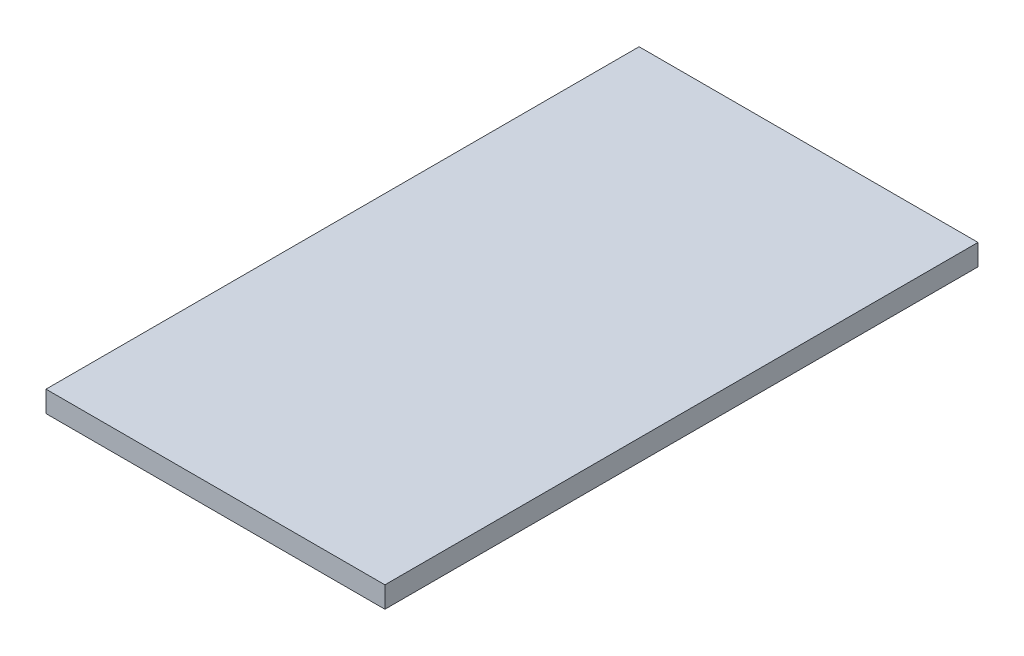
ISO-10303-21;
HEADER;
FILE_DESCRIPTION(('STEP AP214'),'2;1');
FILE_NAME('part.step','',(''),(''),'','','');
FILE_SCHEMA(('AUTOMOTIVE_DESIGN { 1 0 10303 214 1 1 1 1 }'));
ENDSEC;
DATA;
#1=APPLICATION_CONTEXT('core data for automotive mechanical design processes');
#2=APPLICATION_PROTOCOL_DEFINITION('international standard','automotive_design',2000,#1);
#3=PRODUCT_CONTEXT('',#1,'mechanical');
#4=PRODUCT('Part','Part','',(#3));
#5=PRODUCT_RELATED_PRODUCT_CATEGORY('part','',(#4));
#6=PRODUCT_DEFINITION_FORMATION('','',#4);
#7=PRODUCT_DEFINITION_CONTEXT('part definition',#1,'design');
#8=PRODUCT_DEFINITION('design','',#6,#7);
#9=PRODUCT_DEFINITION_SHAPE('','',#8);
#10=(LENGTH_UNIT() NAMED_UNIT(*) SI_UNIT(.MILLI.,.METRE.));
#11=(NAMED_UNIT(*) PLANE_ANGLE_UNIT() SI_UNIT($,.RADIAN.));
#12=(NAMED_UNIT(*) SI_UNIT($,.STERADIAN.) SOLID_ANGLE_UNIT());
#13=UNCERTAINTY_MEASURE_WITH_UNIT(LENGTH_MEASURE(1.E-05),#10,'distance_accuracy_value','');
#14=(GEOMETRIC_REPRESENTATION_CONTEXT(3) GLOBAL_UNCERTAINTY_ASSIGNED_CONTEXT((#13)) GLOBAL_UNIT_ASSIGNED_CONTEXT((#10,
#11,#12)) REPRESENTATION_CONTEXT('',''));
#15=CARTESIAN_POINT('',(0.,0.,0.));
#16=DIRECTION('',(0.,0.,1.));
#17=DIRECTION('',(1.,0.,0.));
#18=AXIS2_PLACEMENT_3D('',#15,#16,#17);
#19=CARTESIAN_POINT('',(-70.2950819672131,10.,-43.2786885245901));
#20=DIRECTION('',(1.,0.,0.));
#21=DIRECTION('',(0.,0.,-1.));
#22=AXIS2_PLACEMENT_3D('',#19,#20,#21);
#23=PLANE('',#22);
#24=DIRECTION('',(0.,0.,1.));
#25=VECTOR('',#24,1.);
#26=CARTESIAN_POINT('',(-70.2950819672131,0.,-43.2786885245901));
#27=LINE('',#26,#25);
#28=CARTESIAN_POINT('',(-70.2950819672131,0.,-43.2786885245901));
#29=VERTEX_POINT('',#28);
#30=CARTESIAN_POINT('',(-70.295081967213,0.,236.72131147541));
#31=VERTEX_POINT('',#30);
#32=EDGE_CURVE('E107',#29,#31,#27,.T.);
#33=ORIENTED_EDGE('',*,*,#32,.T.);
#34=DIRECTION('',(0.,-1.,0.));
#35=VECTOR('',#34,1.);
#36=CARTESIAN_POINT('',(-70.295081967213,10.,236.72131147541));
#37=LINE('',#36,#35);
#38=CARTESIAN_POINT('',(-70.295081967213,10.,236.72131147541));
#39=VERTEX_POINT('',#38);
#40=EDGE_CURVE('E11',#39,#31,#37,.T.);
#41=ORIENTED_EDGE('',*,*,#40,.F.);
#42=DIRECTION('',(0.,0.,1.));
#43=VECTOR('',#42,1.);
#44=CARTESIAN_POINT('',(-70.2950819672131,10.,-43.2786885245901));
#45=LINE('',#44,#43);
#46=CARTESIAN_POINT('',(-70.2950819672131,10.,-43.2786885245901));
#47=VERTEX_POINT('',#46);
#48=EDGE_CURVE('E91',#47,#39,#45,.T.);
#49=ORIENTED_EDGE('',*,*,#48,.F.);
#50=DIRECTION('',(0.,-1.,0.));
#51=VECTOR('',#50,1.);
#52=CARTESIAN_POINT('',(-70.2950819672131,10.,-43.2786885245901));
#53=LINE('',#52,#51);
#54=EDGE_CURVE('E103',#47,#29,#53,.T.);
#55=ORIENTED_EDGE('',*,*,#54,.T.);
#56=EDGE_LOOP('',(#33,#41,#49,#55));
#57=FACE_BOUND('',#56,.T.);
#58=ADVANCED_FACE('F39',(#57),#23,.F.);
#59=CARTESIAN_POINT('',(-70.295081967213,10.,236.72131147541));
#60=DIRECTION('',(0.,0.,-1.));
#61=DIRECTION('',(-1.,0.,0.));
#62=AXIS2_PLACEMENT_3D('',#59,#60,#61);
#63=PLANE('',#62);
#64=DIRECTION('',(1.,0.,0.));
#65=VECTOR('',#64,1.);
#66=CARTESIAN_POINT('',(-70.295081967213,0.,236.72131147541));
#67=LINE('',#66,#65);
#68=CARTESIAN_POINT('',(89.704918032787,0.,236.72131147541));
#69=VERTEX_POINT('',#68);
#70=EDGE_CURVE('E96',#31,#69,#67,.T.);
#71=ORIENTED_EDGE('',*,*,#70,.T.);
#72=DIRECTION('',(0.,-1.,0.));
#73=VECTOR('',#72,1.);
#74=CARTESIAN_POINT('',(89.704918032787,10.,236.72131147541));
#75=LINE('',#74,#73);
#76=CARTESIAN_POINT('',(89.704918032787,10.,236.72131147541));
#77=VERTEX_POINT('',#76);
#78=EDGE_CURVE('E48',#77,#69,#75,.T.);
#79=ORIENTED_EDGE('',*,*,#78,.F.);
#80=DIRECTION('',(1.,0.,0.));
#81=VECTOR('',#80,1.);
#82=CARTESIAN_POINT('',(-70.295081967213,10.,236.72131147541));
#83=LINE('',#82,#81);
#84=EDGE_CURVE('E86',#39,#77,#83,.T.);
#85=ORIENTED_EDGE('',*,*,#84,.F.);
#86=ORIENTED_EDGE('',*,*,#40,.T.);
#87=EDGE_LOOP('',(#71,#79,#85,#86));
#88=FACE_BOUND('',#87,.T.);
#89=ADVANCED_FACE('F95',(#88),#63,.F.);
#90=CARTESIAN_POINT('',(89.7049180327869,10.,-43.2786885245901));
#91=DIRECTION('',(-1.,0.,0.));
#92=DIRECTION('',(0.,0.,1.));
#93=AXIS2_PLACEMENT_3D('',#90,#91,#92);
#94=PLANE('',#93);
#95=DIRECTION('',(0.,0.,-1.));
#96=VECTOR('',#95,1.);
#97=CARTESIAN_POINT('',(89.7049180327869,0.,-43.2786885245901));
#98=LINE('',#97,#96);
#99=CARTESIAN_POINT('',(89.7049180327869,0.,-43.2786885245901));
#100=VERTEX_POINT('',#99);
#101=EDGE_CURVE('E73',#69,#100,#98,.T.);
#102=ORIENTED_EDGE('',*,*,#101,.T.);
#103=DIRECTION('',(0.,-1.,0.));
#104=VECTOR('',#103,1.);
#105=CARTESIAN_POINT('',(89.7049180327869,10.,-43.2786885245901));
#106=LINE('',#105,#104);
#107=CARTESIAN_POINT('',(89.7049180327869,10.,-43.2786885245901));
#108=VERTEX_POINT('',#107);
#109=EDGE_CURVE('E98',#108,#100,#106,.T.);
#110=ORIENTED_EDGE('',*,*,#109,.F.);
#111=DIRECTION('',(0.,0.,-1.));
#112=VECTOR('',#111,1.);
#113=CARTESIAN_POINT('',(89.7049180327869,10.,-43.2786885245901));
#114=LINE('',#113,#112);
#115=EDGE_CURVE('E89',#77,#108,#114,.T.);
#116=ORIENTED_EDGE('',*,*,#115,.F.);
#117=ORIENTED_EDGE('',*,*,#78,.T.);
#118=EDGE_LOOP('',(#102,#110,#116,#117));
#119=FACE_BOUND('',#118,.T.);
#120=ADVANCED_FACE('F99',(#119),#94,.F.);
#121=CARTESIAN_POINT('',(-70.2950819672131,10.,-43.2786885245901));
#122=DIRECTION('',(0.,0.,1.));
#123=DIRECTION('',(1.,0.,0.));
#124=AXIS2_PLACEMENT_3D('',#121,#122,#123);
#125=PLANE('',#124);
#126=DIRECTION('',(-1.,0.,0.));
#127=VECTOR('',#126,1.);
#128=CARTESIAN_POINT('',(-70.2950819672131,0.,-43.2786885245901));
#129=LINE('',#128,#127);
#130=EDGE_CURVE('E79',#100,#29,#129,.T.);
#131=ORIENTED_EDGE('',*,*,#130,.T.);
#132=ORIENTED_EDGE('',*,*,#54,.F.);
#133=DIRECTION('',(-1.,0.,0.));
#134=VECTOR('',#133,1.);
#135=CARTESIAN_POINT('',(-70.2950819672131,10.,-43.2786885245901));
#136=LINE('',#135,#134);
#137=EDGE_CURVE('E56',#108,#47,#136,.T.);
#138=ORIENTED_EDGE('',*,*,#137,.F.);
#139=ORIENTED_EDGE('',*,*,#109,.T.);
#140=EDGE_LOOP('',(#131,#132,#138,#139));
#141=FACE_BOUND('',#140,.T.);
#142=ADVANCED_FACE('F120',(#141),#125,.F.);
#143=CARTESIAN_POINT('',(0.,10.,0.));
#144=DIRECTION('',(0.,1.,0.));
#145=DIRECTION('',(0.,0.,1.));
#146=AXIS2_PLACEMENT_3D('',#143,#144,#145);
#147=PLANE('',#146);
#148=ORIENTED_EDGE('',*,*,#48,.T.);
#149=ORIENTED_EDGE('',*,*,#84,.T.);
#150=ORIENTED_EDGE('',*,*,#115,.T.);
#151=ORIENTED_EDGE('',*,*,#137,.T.);
#152=EDGE_LOOP('',(#148,#149,#150,#151));
#153=FACE_BOUND('',#152,.T.);
#154=ADVANCED_FACE('F87',(#153),#147,.T.);
#155=CARTESIAN_POINT('',(0.,0.,0.));
#156=DIRECTION('',(0.,1.,0.));
#157=DIRECTION('',(0.,0.,1.));
#158=AXIS2_PLACEMENT_3D('',#155,#156,#157);
#159=PLANE('',#158);
#160=ORIENTED_EDGE('',*,*,#32,.F.);
#161=ORIENTED_EDGE('',*,*,#130,.F.);
#162=ORIENTED_EDGE('',*,*,#101,.F.);
#163=ORIENTED_EDGE('',*,*,#70,.F.);
#164=EDGE_LOOP('',(#160,#161,#162,#163));
#165=FACE_BOUND('',#164,.T.);
#166=ADVANCED_FACE('F123',(#165),#159,.F.);
#167=CLOSED_SHELL('',(#58,#89,#120,#142,#154,#166));
#168=MANIFOLD_SOLID_BREP('B2',#167);
#169=ADVANCED_BREP_SHAPE_REPRESENTATION('',(#18,#168),#14);
#170=SHAPE_DEFINITION_REPRESENTATION(#9,#169);
ENDSEC;
END-ISO-10303-21;
